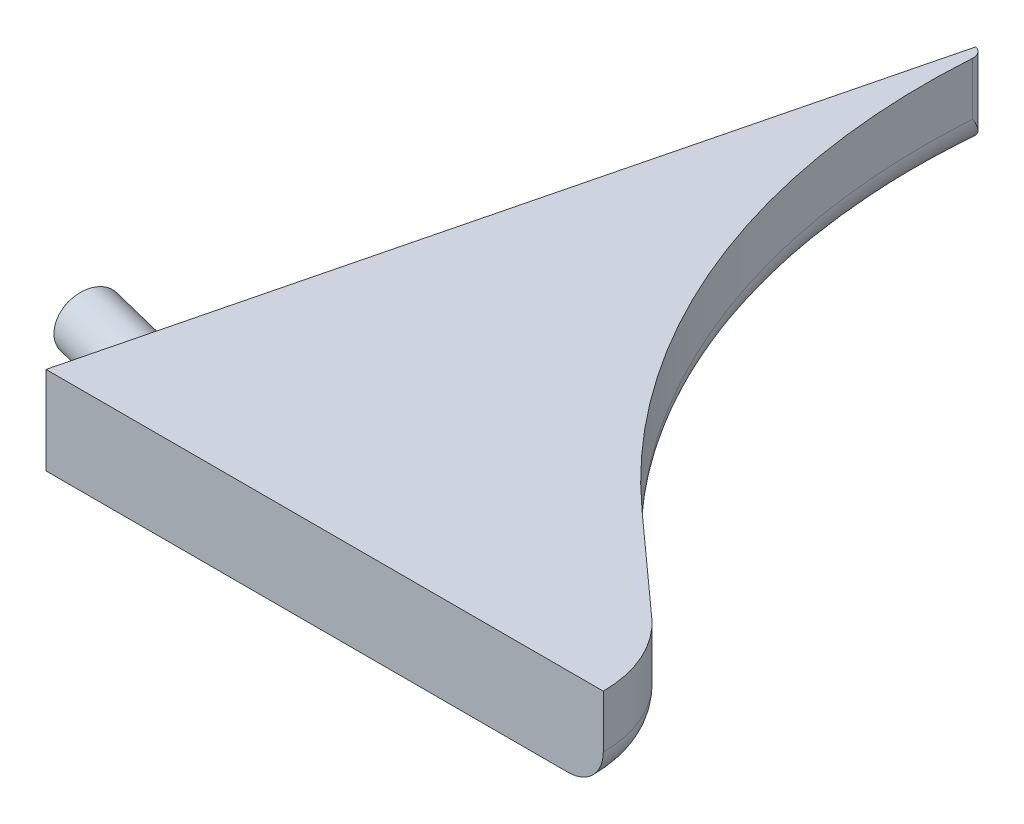
ISO-10303-21;
HEADER;
FILE_DESCRIPTION(('STEP AP214'),'2;1');
FILE_NAME('part.step','',(''),(''),'','','');
FILE_SCHEMA(('AUTOMOTIVE_DESIGN { 1 0 10303 214 1 1 1 1 }'));
ENDSEC;
DATA;
#1=APPLICATION_CONTEXT('core data for automotive mechanical design processes');
#2=APPLICATION_PROTOCOL_DEFINITION('international standard','automotive_design',2000,#1);
#3=PRODUCT_CONTEXT('',#1,'mechanical');
#4=PRODUCT('Part','Part','',(#3));
#5=PRODUCT_RELATED_PRODUCT_CATEGORY('part','',(#4));
#6=PRODUCT_DEFINITION_FORMATION('','',#4);
#7=PRODUCT_DEFINITION_CONTEXT('part definition',#1,'design');
#8=PRODUCT_DEFINITION('design','',#6,#7);
#9=PRODUCT_DEFINITION_SHAPE('','',#8);
#10=(LENGTH_UNIT() NAMED_UNIT(*) SI_UNIT(.MILLI.,.METRE.));
#11=(NAMED_UNIT(*) PLANE_ANGLE_UNIT() SI_UNIT($,.RADIAN.));
#12=(NAMED_UNIT(*) SI_UNIT($,.STERADIAN.) SOLID_ANGLE_UNIT());
#13=UNCERTAINTY_MEASURE_WITH_UNIT(LENGTH_MEASURE(1.E-05),#10,'distance_accuracy_value','');
#14=(GEOMETRIC_REPRESENTATION_CONTEXT(3) GLOBAL_UNCERTAINTY_ASSIGNED_CONTEXT((#13)) GLOBAL_UNIT_ASSIGNED_CONTEXT((#10,
#11,#12)) REPRESENTATION_CONTEXT('',''));
#15=CARTESIAN_POINT('',(0.,0.,0.));
#16=DIRECTION('',(0.,0.,1.));
#17=DIRECTION('',(1.,0.,0.));
#18=AXIS2_PLACEMENT_3D('',#15,#16,#17);
#19=CARTESIAN_POINT('',(0.,2.5,0.));
#20=DIRECTION('',(0.970295726275997,0.,0.241921895599665));
#21=DIRECTION('',(0.241921895599665,0.,-0.970295726275997));
#22=AXIS2_PLACEMENT_3D('',#19,#20,#21);
#23=PLANE('',#22);
#24=CARTESIAN_POINT('',(1.20960947799833,0.,-4.85147863137998));
#25=DIRECTION('',(-0.970295726275997,0.,-0.241921895599665));
#26=DIRECTION('',(-0.241921895599665,0.,0.970295726275997));
#27=AXIS2_PLACEMENT_3D('',#24,#25,#26);
#28=CIRCLE('',#27,2.075);
#29=CARTESIAN_POINT('',(0.707621544629021,0.,-2.83811499935729));
#30=VERTEX_POINT('',#29);
#31=EDGE_CURVE('E219',#30,#30,#28,.T.);
#32=ORIENTED_EDGE('',*,*,#31,.F.);
#33=EDGE_LOOP('',(#32));
#34=FACE_BOUND('',#33,.T.);
#35=DIRECTION('',(0.,-1.,0.));
#36=VECTOR('',#35,1.);
#37=CARTESIAN_POINT('',(10.5531692017754,2.5,-42.3264498228588));
#38=LINE('',#37,#36);
#39=CARTESIAN_POINT('',(10.5531692017754,2.5,-42.3264498228588));
#40=VERTEX_POINT('',#39);
#41=CARTESIAN_POINT('',(10.5531692017754,-1.84213425847109,-42.3264498228588));
#42=VERTEX_POINT('',#41);
#43=EDGE_CURVE('E230',#40,#42,#38,.T.);
#44=ORIENTED_EDGE('',*,*,#43,.T.);
#45=CARTESIAN_POINT('',(10.5531692017754,-1.84213425847109,-42.3264498228588));
#46=CARTESIAN_POINT('',(10.4736044924896,-1.90065699360431,-42.0073332038731));
#47=CARTESIAN_POINT('',(10.3939300597984,-1.95674922550737,-41.6877765083452));
#48=CARTESIAN_POINT('',(10.234325761706,-2.06295763678721,-41.0476386326458));
#49=CARTESIAN_POINT('',(10.1543958294855,-2.11307209433079,-40.7270571844768));
#50=CARTESIAN_POINT('',(9.99449992134999,-2.2060530563124,-40.0857497247766));
#51=CARTESIAN_POINT('',(9.9145345881216,-2.24893819994724,-39.7650262909203));
#52=CARTESIAN_POINT('',(9.75437250421148,-2.32625179990282,-39.1226512584982));
#53=CARTESIAN_POINT('',(9.67417577942809,-2.36068116811255,-38.8009997638049));
#54=CARTESIAN_POINT('',(9.5007796322979,-2.42415767381377,-38.1055458029466));
#55=CARTESIAN_POINT('',(9.40754142343489,-2.4514770750027,-37.7315877725618));
#56=CARTESIAN_POINT('',(9.26746681995411,-2.47990867365997,-37.1697792236485));
#57=CARTESIAN_POINT('',(9.22070384833268,-2.48729544484991,-36.9822231886738));
#58=CARTESIAN_POINT('',(9.12714216795215,-2.49733406836111,-36.606967784894));
#59=CARTESIAN_POINT('',(9.08034345511715,-2.49998525989731,-36.4192683997413));
#60=CARTESIAN_POINT('',(9.03354010471373,-2.5,-36.2315504143177));
#61=B_SPLINE_CURVE_WITH_KNOTS('',3,(#45,#46,#47,#48,#49,#50,#51,#52,#53,#54,#55,#56,#57,#58,#59,
#60),.UNSPECIFIED.,.F.,.F.,(4,2,2,2,2,2,2,4),(0.,1.00217811050621,2.00464419405296,
3.00448473989006,4.00421741338199,5.16300261939556,5.74326796530543,6.32361427294742),.UNSPECIFIED.);
#62=CARTESIAN_POINT('',(9.03354010471373,-2.5,-36.2315504143177));
#63=VERTEX_POINT('',#62);
#64=EDGE_CURVE('E11',#42,#63,#61,.T.);
#65=ORIENTED_EDGE('',*,*,#64,.T.);
#66=DIRECTION('',(-0.241921895599665,0.,0.970295726275997));
#67=VECTOR('',#66,1.);
#68=CARTESIAN_POINT('',(0.,-2.5,0.));
#69=LINE('',#68,#67);
#70=CARTESIAN_POINT('',(0.,-2.5,0.));
#71=VERTEX_POINT('',#70);
#72=EDGE_CURVE('E131',#63,#71,#69,.T.);
#73=ORIENTED_EDGE('',*,*,#72,.T.);
#74=DIRECTION('',(0.,-1.,0.));
#75=VECTOR('',#74,1.);
#76=CARTESIAN_POINT('',(0.,2.5,0.));
#77=LINE('',#76,#75);
#78=CARTESIAN_POINT('',(0.,2.5,0.));
#79=VERTEX_POINT('',#78);
#80=EDGE_CURVE('E115',#79,#71,#77,.T.);
#81=ORIENTED_EDGE('',*,*,#80,.F.);
#82=DIRECTION('',(-0.241921895599665,0.,0.970295726275997));
#83=VECTOR('',#82,1.);
#84=CARTESIAN_POINT('',(0.,2.5,0.));
#85=LINE('',#84,#83);
#86=EDGE_CURVE('E121',#40,#79,#85,.T.);
#87=ORIENTED_EDGE('',*,*,#86,.F.);
#88=EDGE_LOOP('',(#44,#65,#73,#81,#87));
#89=FACE_BOUND('',#88,.T.);
#90=ADVANCED_FACE('F41',(#34,#89),#23,.F.);
#91=CARTESIAN_POINT('',(0.,2.5,0.));
#92=DIRECTION('',(0.,0.,-1.));
#93=DIRECTION('',(-1.,0.,0.));
#94=AXIS2_PLACEMENT_3D('',#91,#92,#93);
#95=PLANE('',#94);
#96=DIRECTION('',(1.,0.,0.));
#97=VECTOR('',#96,1.);
#98=CARTESIAN_POINT('',(0.,-2.5,0.));
#99=LINE('',#98,#97);
#100=CARTESIAN_POINT('',(29.6928403320386,-2.5,0.));
#101=VERTEX_POINT('',#100);
#102=EDGE_CURVE('E128',#71,#101,#99,.T.);
#103=ORIENTED_EDGE('',*,*,#102,.T.);
#104=CARTESIAN_POINT('',(29.6928403320386,-0.5,0.));
#105=DIRECTION('',(0.,0.,-1.));
#106=DIRECTION('',(-1.,0.,0.));
#107=AXIS2_PLACEMENT_3D('',#104,#105,#106);
#108=CIRCLE('',#107,2.);
#109=CARTESIAN_POINT('',(31.6928403320386,-0.5,0.));
#110=VERTEX_POINT('',#109);
#111=EDGE_CURVE('E153',#101,#110,#108,.F.);
#112=ORIENTED_EDGE('',*,*,#111,.T.);
#113=DIRECTION('',(0.,-1.,0.));
#114=VECTOR('',#113,1.);
#115=CARTESIAN_POINT('',(31.6928403320386,2.5,0.));
#116=LINE('',#115,#114);
#117=CARTESIAN_POINT('',(31.6928403320386,2.5,0.));
#118=VERTEX_POINT('',#117);
#119=EDGE_CURVE('E117',#118,#110,#116,.T.);
#120=ORIENTED_EDGE('',*,*,#119,.F.);
#121=DIRECTION('',(1.,0.,0.));
#122=VECTOR('',#121,1.);
#123=CARTESIAN_POINT('',(0.,2.5,0.));
#124=LINE('',#123,#122);
#125=EDGE_CURVE('E110',#79,#118,#124,.T.);
#126=ORIENTED_EDGE('',*,*,#125,.F.);
#127=ORIENTED_EDGE('',*,*,#80,.T.);
#128=EDGE_LOOP('',(#103,#112,#120,#126,#127));
#129=FACE_BOUND('',#128,.T.);
#130=ADVANCED_FACE('F113',(#129),#95,.F.);
#131=CARTESIAN_POINT('',(25.,2.5,0.));
#132=DIRECTION('',(0.,-1.,0.));
#133=DIRECTION('',(0.,0.,-1.));
#134=AXIS2_PLACEMENT_3D('',#131,#132,#133);
#135=CYLINDRICAL_SURFACE('',#134,6.69284033203864);
#136=ORIENTED_EDGE('',*,*,#119,.T.);
#137=CARTESIAN_POINT('',(25.,-0.5,0.));
#138=DIRECTION('',(0.,1.,0.));
#139=DIRECTION('',(0.,0.,1.));
#140=AXIS2_PLACEMENT_3D('',#137,#138,#139);
#141=CIRCLE('',#140,6.69284033203864);
#142=CARTESIAN_POINT('',(29.4794111710163,-0.5,-4.97282487839029));
#143=VERTEX_POINT('',#142);
#144=EDGE_CURVE('E144',#110,#143,#141,.T.);
#145=ORIENTED_EDGE('',*,*,#144,.T.);
#146=DIRECTION('',(0.,-1.,0.));
#147=VECTOR('',#146,1.);
#148=CARTESIAN_POINT('',(29.4794111710163,2.5,-4.97282487839029));
#149=LINE('',#148,#147);
#150=CARTESIAN_POINT('',(29.4794111710163,2.5,-4.97282487839029));
#151=VERTEX_POINT('',#150);
#152=EDGE_CURVE('E138',#151,#143,#149,.T.);
#153=ORIENTED_EDGE('',*,*,#152,.F.);
#154=CARTESIAN_POINT('',(25.,2.5,0.));
#155=DIRECTION('',(0.,1.,0.));
#156=DIRECTION('',(0.,0.,1.));
#157=AXIS2_PLACEMENT_3D('',#154,#155,#156);
#158=CIRCLE('',#157,6.69284033203864);
#159=EDGE_CURVE('E120',#118,#151,#158,.T.);
#160=ORIENTED_EDGE('',*,*,#159,.F.);
#161=EDGE_LOOP('',(#136,#145,#153,#160));
#162=FACE_BOUND('',#161,.T.);
#163=ADVANCED_FACE('F181',(#162),#135,.T.);
#164=CARTESIAN_POINT('',(23.8549002403687,2.5,-10.039260498058));
#165=DIRECTION('',(-0.669284033203865,0.,0.743006650642083));
#166=DIRECTION('',(0.743006650642083,0.,0.669284033203865));
#167=AXIS2_PLACEMENT_3D('',#164,#165,#166);
#168=PLANE('',#167);
#169=ORIENTED_EDGE('',*,*,#152,.T.);
#170=DIRECTION('',(-0.743006650642083,0.,-0.669284033203865));
#171=VECTOR('',#170,1.);
#172=CARTESIAN_POINT('',(23.8549002403687,-0.5,-10.039260498058));
#173=LINE('',#172,#171);
#174=CARTESIAN_POINT('',(23.8549002403687,-0.5,-10.039260498058));
#175=VERTEX_POINT('',#174);
#176=EDGE_CURVE('E155',#143,#175,#173,.T.);
#177=ORIENTED_EDGE('',*,*,#176,.T.);
#178=DIRECTION('',(0.,-1.,0.));
#179=VECTOR('',#178,1.);
#180=CARTESIAN_POINT('',(23.8549002403687,2.5,-10.039260498058));
#181=LINE('',#180,#179);
#182=CARTESIAN_POINT('',(23.8549002403687,2.5,-10.039260498058));
#183=VERTEX_POINT('',#182);
#184=EDGE_CURVE('E234',#183,#175,#181,.T.);
#185=ORIENTED_EDGE('',*,*,#184,.F.);
#186=DIRECTION('',(-0.743006650642083,0.,-0.669284033203865));
#187=VECTOR('',#186,1.);
#188=CARTESIAN_POINT('',(23.8549002403687,2.5,-10.039260498058));
#189=LINE('',#188,#187);
#190=EDGE_CURVE('E239',#151,#183,#189,.T.);
#191=ORIENTED_EDGE('',*,*,#190,.F.);
#192=EDGE_LOOP('',(#169,#177,#185,#191));
#193=FACE_BOUND('',#192,.T.);
#194=ADVANCED_FACE('F178',(#193),#168,.F.);
#195=CARTESIAN_POINT('',(50.,2.5,-39.064281325336));
#196=DIRECTION('',(0.,-1.,0.));
#197=DIRECTION('',(0.,0.,-1.));
#198=AXIS2_PLACEMENT_3D('',#195,#196,#197);
#199=CYLINDRICAL_SURFACE('',#198,39.064281325336);
#200=ORIENTED_EDGE('',*,*,#184,.T.);
#201=CARTESIAN_POINT('',(50.,-0.5,-39.064281325336));
#202=DIRECTION('',(0.,1.,0.));
#203=DIRECTION('',(0.,0.,1.));
#204=AXIS2_PLACEMENT_3D('',#201,#202,#203);
#205=CIRCLE('',#204,39.064281325336);
#206=CARTESIAN_POINT('',(11.0234600353836,-0.5,-41.6810365396527));
#207=VERTEX_POINT('',#206);
#208=EDGE_CURVE('E66',#175,#207,#205,.F.);
#209=ORIENTED_EDGE('',*,*,#208,.T.);
#210=DIRECTION('',(0.,-1.,0.));
#211=VECTOR('',#210,1.);
#212=CARTESIAN_POINT('',(11.0234600353836,2.5,-41.6810365396527));
#213=LINE('',#212,#211);
#214=CARTESIAN_POINT('',(11.0234600353836,2.5,-41.6810365396527));
#215=VERTEX_POINT('',#214);
#216=EDGE_CURVE('E232',#215,#207,#213,.T.);
#217=ORIENTED_EDGE('',*,*,#216,.F.);
#218=CARTESIAN_POINT('',(50.,2.5,-39.064281325336));
#219=DIRECTION('',(0.,-1.,0.));
#220=DIRECTION('',(0.,0.,1.));
#221=AXIS2_PLACEMENT_3D('',#218,#219,#220);
#222=CIRCLE('',#221,39.064281325336);
#223=EDGE_CURVE('E241',#183,#215,#222,.T.);
#224=ORIENTED_EDGE('',*,*,#223,.F.);
#225=EDGE_LOOP('',(#200,#209,#217,#224));
#226=FACE_BOUND('',#225,.T.);
#227=ADVANCED_FACE('F173',(#226),#199,.F.);
#228=CARTESIAN_POINT('',(10.4026415107856,2.5,-41.7227162298679));
#229=DIRECTION('',(0.,-1.,0.));
#230=DIRECTION('',(0.,0.,-1.));
#231=AXIS2_PLACEMENT_3D('',#228,#229,#230);
#232=CYLINDRICAL_SURFACE('',#231,0.62221606943285);
#233=ORIENTED_EDGE('',*,*,#216,.T.);
#234=CARTESIAN_POINT('',(10.5531692017754,-1.84213425847109,-42.3264498228588));
#235=CARTESIAN_POINT('',(10.5787240925099,-1.81342077303304,-42.3200662935403));
#236=CARTESIAN_POINT('',(10.6031781353264,-1.78410441626142,-42.3122595480172));
#237=CARTESIAN_POINT('',(10.6498363389319,-1.72451585811791,-42.2942706195236));
#238=CARTESIAN_POINT('',(10.6720446533543,-1.69424556243192,-42.2840929414307));
#239=CARTESIAN_POINT('',(10.7350669360837,-1.6026473647285,-42.250820440383));
#240=CARTESIAN_POINT('',(10.7726407143271,-1.54011910549984,-42.2248824574302));
#241=CARTESIAN_POINT('',(10.856376739508,-1.38079748360859,-42.1535957154304));
#242=CARTESIAN_POINT('',(10.8972557405541,-1.28268411146188,-42.1050682002808));
#243=CARTESIAN_POINT('',(10.9619311981863,-1.08374948043426,-42.002102822041));
#244=CARTESIAN_POINT('',(10.9856610896422,-0.982919229006879,-41.9476428625034));
#245=CARTESIAN_POINT('',(11.0206033201424,-0.757466328250552,-41.8240049664862));
#246=CARTESIAN_POINT('',(11.0278787333669,-0.632520663571082,-41.7542389450933));
#247=CARTESIAN_POINT('',(11.0236484039771,-0.505217167708969,-41.6839174642601));
#248=CARTESIAN_POINT('',(11.023556716328,-0.502608523307459,-41.6824767959273));
#249=CARTESIAN_POINT('',(11.0234600353836,-0.5,-41.6810365396527));
#250=B_SPLINE_CURVE_WITH_KNOTS('',3,(#234,#235,#236,#237,#238,#239,#240,#241,#242,#243,#244,
#245,#246,#247,#248,#249),.UNSPECIFIED.,.F.,.F.,(4,2,2,2,2,2,2,4),(0.,0.116780284029613,
0.233340464468333,0.464803667704966,0.813456195141592,1.16345487057803,1.59097895313023,
1.59992323773839),.UNSPECIFIED.);
#251=EDGE_CURVE('E51',#207,#42,#250,.F.);
#252=ORIENTED_EDGE('',*,*,#251,.T.);
#253=ORIENTED_EDGE('',*,*,#43,.F.);
#254=CARTESIAN_POINT('',(10.4026415107856,2.5,-41.7227162298679));
#255=DIRECTION('',(0.,1.,0.));
#256=DIRECTION('',(0.,0.,1.));
#257=AXIS2_PLACEMENT_3D('',#254,#255,#256);
#258=CIRCLE('',#257,0.62221606943285);
#259=EDGE_CURVE('E126',#215,#40,#258,.T.);
#260=ORIENTED_EDGE('',*,*,#259,.F.);
#261=EDGE_LOOP('',(#233,#252,#253,#260));
#262=FACE_BOUND('',#261,.T.);
#263=ADVANCED_FACE('F168',(#262),#232,.T.);
#264=CARTESIAN_POINT('',(10.4026415107856,2.5,-41.7227162298679));
#265=DIRECTION('',(0.,1.,0.));
#266=DIRECTION('',(0.,0.,1.));
#267=AXIS2_PLACEMENT_3D('',#264,#265,#266);
#268=PLANE('',#267);
#269=ORIENTED_EDGE('',*,*,#86,.T.);
#270=ORIENTED_EDGE('',*,*,#125,.T.);
#271=ORIENTED_EDGE('',*,*,#159,.T.);
#272=ORIENTED_EDGE('',*,*,#190,.T.);
#273=ORIENTED_EDGE('',*,*,#223,.T.);
#274=ORIENTED_EDGE('',*,*,#259,.T.);
#275=EDGE_LOOP('',(#269,#270,#271,#272,#273,#274));
#276=FACE_BOUND('',#275,.T.);
#277=ADVANCED_FACE('F124',(#276),#268,.T.);
#278=CARTESIAN_POINT('',(10.4026415107856,-2.5,-41.7227162298679));
#279=DIRECTION('',(0.,1.,0.));
#280=DIRECTION('',(0.,0.,1.));
#281=AXIS2_PLACEMENT_3D('',#278,#279,#280);
#282=PLANE('',#281);
#283=DIRECTION('',(-0.743006650642083,0.,-0.669284033203865));
#284=VECTOR('',#283,1.);
#285=CARTESIAN_POINT('',(-0.665734442404647,-2.5,-29.4351424390223));
#286=LINE('',#285,#284);
#287=CARTESIAN_POINT('',(22.516332173961,-2.5,-8.5532471967738));
#288=VERTEX_POINT('',#287);
#289=CARTESIAN_POINT('',(28.1408431046086,-2.5,-3.48681157710612));
#290=VERTEX_POINT('',#289);
#291=EDGE_CURVE('E149',#288,#290,#286,.F.);
#292=ORIENTED_EDGE('',*,*,#291,.T.);
#293=CARTESIAN_POINT('',(25.,-2.5,0.));
#294=DIRECTION('',(0.,1.,0.));
#295=DIRECTION('',(0.,0.,1.));
#296=AXIS2_PLACEMENT_3D('',#293,#294,#295);
#297=CIRCLE('',#296,4.69284033203864);
#298=EDGE_CURVE('E151',#290,#101,#297,.F.);
#299=ORIENTED_EDGE('',*,*,#298,.T.);
#300=ORIENTED_EDGE('',*,*,#102,.F.);
#301=ORIENTED_EDGE('',*,*,#72,.F.);
#302=CARTESIAN_POINT('',(50.,-2.5,-39.064281325336));
#303=DIRECTION('',(0.,1.,0.));
#304=DIRECTION('',(0.,0.,1.));
#305=AXIS2_PLACEMENT_3D('',#302,#303,#304);
#306=CIRCLE('',#305,41.064281325336);
#307=EDGE_CURVE('E147',#63,#288,#306,.T.);
#308=ORIENTED_EDGE('',*,*,#307,.T.);
#309=EDGE_LOOP('',(#292,#299,#300,#301,#308));
#310=FACE_BOUND('',#309,.T.);
#311=ADVANCED_FACE('F174',(#310),#282,.F.);
#312=CARTESIAN_POINT('',(1.20960947799832,0.,-4.85147863137999));
#313=DIRECTION('',(-0.970295726275997,0.,-0.241921895599665));
#314=DIRECTION('',(-0.241921895599665,0.,0.970295726275997));
#315=AXIS2_PLACEMENT_3D('',#312,#313,#314);
#316=TOROIDAL_SURFACE('',#315,1.775,0.15);
#317=CARTESIAN_POINT('',(1.20960947799832,0.,-4.85147863137999));
#318=DIRECTION('',(-0.970295726275997,0.,-0.241921895599665));
#319=DIRECTION('',(-0.241921895599665,0.,0.970295726275997));
#320=AXIS2_PLACEMENT_3D('',#317,#318,#319);
#321=CIRCLE('',#320,1.625);
#322=CARTESIAN_POINT('',(1.60273255834778,0.,-6.42820918657848));
#323=VERTEX_POINT('',#322);
#324=EDGE_CURVE('E216',#323,#323,#321,.T.);
#325=ORIENTED_EDGE('',*,*,#324,.F.);
#326=EDGE_LOOP('',(#325));
#327=FACE_BOUND('',#326,.T.);
#328=CARTESIAN_POINT('',(1.31706685101772,0.,-4.82468649917429));
#329=DIRECTION('',(-0.970295726275997,0.,-0.241921895599665));
#330=DIRECTION('',(-0.241921895599665,0.,0.970295726275997));
#331=AXIS2_PLACEMENT_3D('',#328,#329,#330);
#332=CIRCLE('',#331,1.87616864452805);
#333=CARTESIAN_POINT('',(0.863180576068835,0.,-3.00424808161569));
#334=VERTEX_POINT('',#333);
#335=EDGE_CURVE('E226',#334,#334,#332,.T.);
#336=ORIENTED_EDGE('',*,*,#335,.T.);
#337=EDGE_LOOP('',(#336));
#338=FACE_BOUND('',#337,.T.);
#339=ADVANCED_FACE('F266',(#327,#338),#316,.F.);
#340=CARTESIAN_POINT('',(1.26039212589433,0.,-4.83881709520099));
#341=DIRECTION('',(-0.970295726275997,0.,-0.241921895599665));
#342=DIRECTION('',(-0.241921895599665,0.,0.970295726275997));
#343=AXIS2_PLACEMENT_3D('',#340,#341,#342);
#344=CONICAL_SURFACE('',#343,1.9401084739626,0.830566477643062);
#345=CARTESIAN_POINT('',(1.26039212589433,0.,-4.83881709520099));
#346=DIRECTION('',(-0.970295726275997,0.,-0.241921895599665));
#347=DIRECTION('',(-0.241921895599665,0.,0.970295726275997));
#348=AXIS2_PLACEMENT_3D('',#345,#346,#347);
#349=CIRCLE('',#348,1.9401084739626);
#350=CARTESIAN_POINT('',(0.791037406204327,0.,-2.95633813440323));
#351=VERTEX_POINT('',#350);
#352=EDGE_CURVE('E249',#351,#351,#349,.T.);
#353=CARTESIAN_POINT('',(0.863180576068835,0.,-3.00424808161569));
#354=CARTESIAN_POINT('',(0.86242908471608,0.,-3.00374901966556));
#355=CARTESIAN_POINT('',(0.861677593363325,0.,-3.00324995771543));
#356=CARTESIAN_POINT('',(0.860174610657814,0.,-3.00225183381517));
#357=CARTESIAN_POINT('',(0.859423119305059,0.,-3.00175277186504));
#358=CARTESIAN_POINT('',(0.857920136599548,0.,-3.00075464796478));
#359=CARTESIAN_POINT('',(0.857168645246793,0.,-3.00025558601465));
#360=CARTESIAN_POINT('',(0.855665662541283,0.,-2.99925746211439));
#361=CARTESIAN_POINT('',(0.854914171188527,0.,-2.99875840016426));
#362=CARTESIAN_POINT('',(0.853411188483017,0.,-2.997760276264));
#363=CARTESIAN_POINT('',(0.852659697130261,0.,-2.99726121431387));
#364=CARTESIAN_POINT('',(0.851156714424751,0.,-2.99626309041361));
#365=CARTESIAN_POINT('',(0.850405223071996,0.,-2.99576402846348));
#366=CARTESIAN_POINT('',(0.848902240366485,0.,-2.99476590456322));
#367=CARTESIAN_POINT('',(0.84815074901373,0.,-2.99426684261309));
#368=CARTESIAN_POINT('',(0.846647766308219,0.,-2.99326871871283));
#369=CARTESIAN_POINT('',(0.845896274955464,0.,-2.9927696567627));
#370=CARTESIAN_POINT('',(0.844393292249953,0.,-2.99177153286244));
#371=CARTESIAN_POINT('',(0.843641800897198,0.,-2.99127247091231));
#372=CARTESIAN_POINT('',(0.842138818191687,0.,-2.99027434701205));
#373=CARTESIAN_POINT('',(0.841387326838932,0.,-2.98977528506192));
#374=CARTESIAN_POINT('',(0.839884344133422,0.,-2.98877716116166));
#375=CARTESIAN_POINT('',(0.839132852780666,0.,-2.98827809921153));
#376=CARTESIAN_POINT('',(0.837629870075156,0.,-2.98727997531127));
#377=CARTESIAN_POINT('',(0.8368783787224,0.,-2.98678091336114));
#378=CARTESIAN_POINT('',(0.83537539601689,0.,-2.98578278946089));
#379=CARTESIAN_POINT('',(0.834623904664134,0.,-2.98528372751076));
#380=CARTESIAN_POINT('',(0.833120921958624,0.,-2.9842856036105));
#381=CARTESIAN_POINT('',(0.832369430605868,0.,-2.98378654166037));
#382=CARTESIAN_POINT('',(0.830866447900358,0.,-2.98278841776011));
#383=CARTESIAN_POINT('',(0.830114956547603,0.,-2.98228935580998));
#384=CARTESIAN_POINT('',(0.828611973842092,0.,-2.98129123190972));
#385=CARTESIAN_POINT('',(0.827860482489337,0.,-2.98079216995959));
#386=CARTESIAN_POINT('',(0.826357499783826,0.,-2.97979404605933));
#387=CARTESIAN_POINT('',(0.825606008431071,0.,-2.9792949841092));
#388=CARTESIAN_POINT('',(0.82410302572556,0.,-2.97829686020894));
#389=CARTESIAN_POINT('',(0.823351534372805,0.,-2.97779779825881));
#390=CARTESIAN_POINT('',(0.821848551667294,0.,-2.97679967435855));
#391=CARTESIAN_POINT('',(0.821097060314539,0.,-2.97630061240842));
#392=CARTESIAN_POINT('',(0.819594077609028,0.,-2.97530248850816));
#393=CARTESIAN_POINT('',(0.818842586256273,0.,-2.97480342655803));
#394=CARTESIAN_POINT('',(0.817339603550763,0.,-2.97380530265777));
#395=CARTESIAN_POINT('',(0.816588112198007,0.,-2.97330624070764));
#396=CARTESIAN_POINT('',(0.815085129492497,0.,-2.97230811680738));
#397=CARTESIAN_POINT('',(0.814333638139742,0.,-2.97180905485725));
#398=CARTESIAN_POINT('',(0.812830655434231,0.,-2.97081093095699));
#399=CARTESIAN_POINT('',(0.812079164081476,0.,-2.97031186900686));
#400=CARTESIAN_POINT('',(0.810576181375965,0.,-2.9693137451066));
#401=CARTESIAN_POINT('',(0.80982469002321,0.,-2.96881468315647));
#402=CARTESIAN_POINT('',(0.808321707317699,0.,-2.96781655925621));
#403=CARTESIAN_POINT('',(0.807570215964944,0.,-2.96731749730608));
#404=CARTESIAN_POINT('',(0.806067233259433,0.,-2.96631937340582));
#405=CARTESIAN_POINT('',(0.805315741906678,0.,-2.96582031145569));
#406=CARTESIAN_POINT('',(0.803812759201167,0.,-2.96482218755544));
#407=CARTESIAN_POINT('',(0.803061267848412,0.,-2.96432312560531));
#408=CARTESIAN_POINT('',(0.801558285142901,0.,-2.96332500170505));
#409=CARTESIAN_POINT('',(0.800806793790146,0.,-2.96282593975492));
#410=CARTESIAN_POINT('',(0.799303811084636,0.,-2.96182781585466));
#411=CARTESIAN_POINT('',(0.79855231973188,0.,-2.96132875390453));
#412=CARTESIAN_POINT('',(0.79704933702637,0.,-2.96033063000427));
#413=CARTESIAN_POINT('',(0.796297845673614,0.,-2.95983156805414));
#414=CARTESIAN_POINT('',(0.794794862968104,0.,-2.95883344415388));
#415=CARTESIAN_POINT('',(0.794043371615348,0.,-2.95833438220375));
#416=CARTESIAN_POINT('',(0.792540388909838,0.,-2.95733625830349));
#417=CARTESIAN_POINT('',(0.791788897557083,0.,-2.95683719635336));
#418=CARTESIAN_POINT('',(0.791037406204327,0.,-2.95633813440323));
#419=B_SPLINE_CURVE_WITH_KNOTS('',3,(#353,#354,#355,#356,#357,#358,#359,#360,#361,#362,#363,
#364,#365,#366,#367,#368,#369,#370,#371,#372,#373,#374,#375,#376,#377,#378,#379,#380,#381,#382,
#383,#384,#385,#386,#387,#388,#389,#390,#391,#392,#393,#394,#395,#396,#397,#398,#399,#400,#401,
#402,#403,#404,#405,#406,#407,#408,#409,#410,#411,#412,#413,#414,#415,#416,#417,#418),
.UNSPECIFIED.,.F.,.F.,(4,2,2,2,2,2,2,2,2,2,2,2,2,2,2,2,2,2,2,2,2,2,2,2,2,2,2,2,2,2,2,2,4),(0.,
0.00270632938682652,0.00541265877365264,0.00811898816047877,0.0108253175473052,
0.0135316469341316,0.016237976320958,0.0189443057077841,0.0216506350946104,0.0243569644814367,
0.0270632938682631,0.0297696232550895,0.0324759526419157,0.035182282028742,0.0378886114155682,
0.0405949408023948,0.0433012701892211,0.0460075995760476,0.0487139289628735,0.0514202583496998,
0.0541265877365261,0.0568329171233525,0.0595392465101791,0.0622455758970053,0.0649519052838318,
0.0676582346706578,0.0703645640574842,0.0730708934443105,0.0757772228311369,0.0784835522179633,
0.0811898816047894,0.0838962109916158,0.0866025403784422),.UNSPECIFIED.);
#420=EDGE_CURVE('BSEAM257',#334,#351,#419,.T.);
#421=ORIENTED_EDGE('',*,*,#335,.F.);
#422=ORIENTED_EDGE('',*,*,#352,.T.);
#423=ORIENTED_EDGE('',*,*,#420,.T.);
#424=ORIENTED_EDGE('',*,*,#420,.F.);
#425=EDGE_LOOP('',(#421,#423,#422,#424));
#426=FACE_BOUND('',#425,.T.);
#427=ADVANCED_FACE('F257',(#426),#344,.F.);
#428=CARTESIAN_POINT('',(1.40366862325352,0.,-4.80309425226005));
#429=DIRECTION('',(-0.970295726275997,0.,-0.241921895599665));
#430=DIRECTION('',(-0.241921895599665,0.,0.970295726275997));
#431=AXIS2_PLACEMENT_3D('',#428,#429,#430);
#432=TOROIDAL_SURFACE('',#431,2.075,0.199999999999999);
#433=ORIENTED_EDGE('',*,*,#352,.F.);
#434=EDGE_LOOP('',(#433));
#435=FACE_BOUND('',#434,.T.);
#436=ORIENTED_EDGE('',*,*,#31,.T.);
#437=EDGE_LOOP('',(#436));
#438=FACE_BOUND('',#437,.T.);
#439=ADVANCED_FACE('F255',(#435,#438),#432,.T.);
#440=CARTESIAN_POINT('',(-4.12701701651966,0.,-6.18204905717814));
#441=DIRECTION('',(-0.970295726275997,0.,-0.241921895599665));
#442=DIRECTION('',(-0.241921895599665,0.,0.970295726275997));
#443=AXIS2_PLACEMENT_3D('',#440,#441,#442);
#444=PLANE('',#443);
#445=CARTESIAN_POINT('',(-4.12701701651966,0.,-6.18204905717814));
#446=DIRECTION('',(-0.970295726275997,0.,-0.241921895599665));
#447=DIRECTION('',(-0.241921895599665,0.,0.970295726275997));
#448=AXIS2_PLACEMENT_3D('',#445,#446,#447);
#449=CIRCLE('',#448,1.125);
#450=CARTESIAN_POINT('',(-3.85485488397004,0.,-7.27363174923864));
#451=VERTEX_POINT('',#450);
#452=EDGE_CURVE('E133',#451,#451,#449,.T.);
#453=ORIENTED_EDGE('',*,*,#452,.T.);
#454=EDGE_LOOP('',(#453));
#455=FACE_BOUND('',#454,.T.);
#456=ADVANCED_FACE('F198',(#455),#444,.T.);
#457=CARTESIAN_POINT('',(-4.12701701651966,0.,-6.18204905717814));
#458=DIRECTION('',(0.970295726275997,0.,0.241921895599665));
#459=DIRECTION('',(0.241921895599665,0.,-0.970295726275997));
#460=AXIS2_PLACEMENT_3D('',#457,#458,#459);
#461=CONICAL_SURFACE('',#460,1.125,0.78539816339745);
#462=CARTESIAN_POINT('',(-3.64186915338166,0.,-6.06108810937831));
#463=DIRECTION('',(-0.970295726275997,0.,-0.241921895599665));
#464=DIRECTION('',(-0.241921895599665,0.,0.970295726275997));
#465=AXIS2_PLACEMENT_3D('',#462,#463,#464);
#466=CIRCLE('',#465,1.625);
#467=CARTESIAN_POINT('',(-3.24874607303221,0.,-7.63781866457681));
#468=VERTEX_POINT('',#467);
#469=EDGE_CURVE('E136',#468,#468,#466,.F.);
#470=CARTESIAN_POINT('',(-3.24874607303221,0.,-7.63781866457681));
#471=CARTESIAN_POINT('',(-3.25505970647948,0.,-7.63402505087537));
#472=CARTESIAN_POINT('',(-3.26137333992675,0.,-7.63023143717393));
#473=CARTESIAN_POINT('',(-3.27400060682128,0.,-7.62264420977105));
#474=CARTESIAN_POINT('',(-3.28031424026855,0.,-7.61885059606961));
#475=CARTESIAN_POINT('',(-3.29294150716309,0.,-7.61126336866673));
#476=CARTESIAN_POINT('',(-3.29925514061036,0.,-7.60746975496529));
#477=CARTESIAN_POINT('',(-3.3118824075049,0.,-7.59988252756242));
#478=CARTESIAN_POINT('',(-3.31819604095217,0.,-7.59608891386098));
#479=CARTESIAN_POINT('',(-3.33082330784671,0.,-7.5885016864581));
#480=CARTESIAN_POINT('',(-3.33713694129397,0.,-7.58470807275666));
#481=CARTESIAN_POINT('',(-3.34976420818851,0.,-7.57712084535378));
#482=CARTESIAN_POINT('',(-3.35607784163578,0.,-7.57332723165234));
#483=CARTESIAN_POINT('',(-3.36870510853032,0.,-7.56574000424946));
#484=CARTESIAN_POINT('',(-3.37501874197759,0.,-7.56194639054802));
#485=CARTESIAN_POINT('',(-3.38764600887213,0.,-7.55435916314515));
#486=CARTESIAN_POINT('',(-3.3939596423194,0.,-7.55056554944371));
#487=CARTESIAN_POINT('',(-3.40658690921393,0.,-7.54297832204083));
#488=CARTESIAN_POINT('',(-3.4129005426612,0.,-7.53918470833939));
#489=CARTESIAN_POINT('',(-3.42552780955574,0.,-7.53159748093651));
#490=CARTESIAN_POINT('',(-3.43184144300301,0.,-7.52780386723507));
#491=CARTESIAN_POINT('',(-3.44446870989755,0.,-7.52021663983219));
#492=CARTESIAN_POINT('',(-3.45078234334482,0.,-7.51642302613075));
#493=CARTESIAN_POINT('',(-3.46340961023936,0.,-7.50883579872787));
#494=CARTESIAN_POINT('',(-3.46972324368662,0.,-7.50504218502644));
#495=CARTESIAN_POINT('',(-3.48235051058116,0.,-7.49745495762356));
#496=CARTESIAN_POINT('',(-3.48866414402843,0.,-7.49366134392212));
#497=CARTESIAN_POINT('',(-3.50129141092297,0.,-7.48607411651924));
#498=CARTESIAN_POINT('',(-3.50760504437024,0.,-7.4822805028178));
#499=CARTESIAN_POINT('',(-3.52023231126478,0.,-7.47469327541492));
#500=CARTESIAN_POINT('',(-3.52654594471205,0.,-7.47089966171348));
#501=CARTESIAN_POINT('',(-3.53917321160658,0.,-7.4633124343106));
#502=CARTESIAN_POINT('',(-3.54548684505385,0.,-7.45951882060916));
#503=CARTESIAN_POINT('',(-3.55811411194839,0.,-7.45193159320629));
#504=CARTESIAN_POINT('',(-3.56442774539566,0.,-7.44813797950485));
#505=CARTESIAN_POINT('',(-3.5770550122902,0.,-7.44055075210197));
#506=CARTESIAN_POINT('',(-3.58336864573747,0.,-7.43675713840053));
#507=CARTESIAN_POINT('',(-3.595995912632,0.,-7.42916991099765));
#508=CARTESIAN_POINT('',(-3.60230954607927,0.,-7.42537629729621));
#509=CARTESIAN_POINT('',(-3.61493681297381,0.,-7.41778906989333));
#510=CARTESIAN_POINT('',(-3.62125044642108,0.,-7.41399545619189));
#511=CARTESIAN_POINT('',(-3.63387771331562,0.,-7.40640822878901));
#512=CARTESIAN_POINT('',(-3.64019134676289,0.,-7.40261461508757));
#513=CARTESIAN_POINT('',(-3.65281861365743,0.,-7.3950273876847));
#514=CARTESIAN_POINT('',(-3.65913224710469,0.,-7.39123377398326));
#515=CARTESIAN_POINT('',(-3.67175951399923,0.,-7.38364654658038));
#516=CARTESIAN_POINT('',(-3.6780731474465,0.,-7.37985293287894));
#517=CARTESIAN_POINT('',(-3.69070041434104,0.,-7.37226570547606));
#518=CARTESIAN_POINT('',(-3.69701404778831,0.,-7.36847209177462));
#519=CARTESIAN_POINT('',(-3.70964131468285,0.,-7.36088486437174));
#520=CARTESIAN_POINT('',(-3.71595494813012,0.,-7.3570912506703));
#521=CARTESIAN_POINT('',(-3.72858221502465,0.,-7.34950402326743));
#522=CARTESIAN_POINT('',(-3.73489584847192,0.,-7.34571040956599));
#523=CARTESIAN_POINT('',(-3.74752311536646,0.,-7.33812318216311));
#524=CARTESIAN_POINT('',(-3.75383674881373,0.,-7.33432956846167));
#525=CARTESIAN_POINT('',(-3.76646401570827,0.,-7.32674234105879));
#526=CARTESIAN_POINT('',(-3.77277764915554,0.,-7.32294872735735));
#527=CARTESIAN_POINT('',(-3.78540491605008,0.,-7.31536149995447));
#528=CARTESIAN_POINT('',(-3.79171854949734,0.,-7.31156788625303));
#529=CARTESIAN_POINT('',(-3.80434581639188,0.,-7.30398065885016));
#530=CARTESIAN_POINT('',(-3.81065944983915,0.,-7.30018704514872));
#531=CARTESIAN_POINT('',(-3.82328671673369,0.,-7.29259981774584));
#532=CARTESIAN_POINT('',(-3.82960035018096,0.,-7.2888062040444));
#533=CARTESIAN_POINT('',(-3.8422276170755,0.,-7.28121897664152));
#534=CARTESIAN_POINT('',(-3.84854125052277,0.,-7.27742536294008));
#535=CARTESIAN_POINT('',(-3.85485488397004,0.,-7.27363174923864));
#536=B_SPLINE_CURVE_WITH_KNOTS('',3,(#470,#471,#472,#473,#474,#475,#476,#477,#478,#479,#480,
#481,#482,#483,#484,#485,#486,#487,#488,#489,#490,#491,#492,#493,#494,#495,#496,#497,#498,#499,
#500,#501,#502,#503,#504,#505,#506,#507,#508,#509,#510,#511,#512,#513,#514,#515,#516,#517,#518,
#519,#520,#521,#522,#523,#524,#525,#526,#527,#528,#529,#530,#531,#532,#533,#534,#535),
.UNSPECIFIED.,.F.,.F.,(4,2,2,2,2,2,2,2,2,2,2,2,2,2,2,2,2,2,2,2,2,2,2,2,2,2,2,2,2,2,2,2,4),(0.,
0.0220970869120797,0.0441941738241593,0.0662912607362386,0.0883883476483183,0.110485434560398,
0.132582521472477,0.154679608384557,0.176776695296636,0.198873782208716,0.220970869120795,
0.243067956032874,0.265165042944955,0.287262129857034,0.309359216769113,0.331456303681194,
0.353553390593272,0.375650477505352,0.397747564417431,0.419844651329511,0.44194173824159,
0.46403882515367,0.486135912065749,0.508232998977829,0.530330085889908,0.552427172801987,
0.574524259714067,0.596621346626147,0.618718433538226,0.640815520450306,0.662912607362385,
0.685009694274465,0.707106781186544),.UNSPECIFIED.);
#537=EDGE_CURVE('BSEAM192',#468,#451,#536,.T.);
#538=ORIENTED_EDGE('',*,*,#469,.F.);
#539=ORIENTED_EDGE('',*,*,#452,.F.);
#540=ORIENTED_EDGE('',*,*,#537,.T.);
#541=ORIENTED_EDGE('',*,*,#537,.F.);
#542=EDGE_LOOP('',(#538,#540,#539,#541));
#543=FACE_BOUND('',#542,.T.);
#544=ADVANCED_FACE('F192',(#543),#461,.T.);
#545=CARTESIAN_POINT('',(-4.12701701651966,0.,-6.18204905717814));
#546=DIRECTION('',(0.970295726275997,0.,0.241921895599665));
#547=DIRECTION('',(0.241921895599665,0.,-0.970295726275997));
#548=AXIS2_PLACEMENT_3D('',#545,#546,#547);
#549=CYLINDRICAL_SURFACE('',#548,1.625);
#550=CARTESIAN_POINT('',(-3.24874607303221,0.,-7.63781866457681));
#551=CARTESIAN_POINT('',(-3.19820983728867,0.,-7.62521856584766));
#552=CARTESIAN_POINT('',(-3.14767360154513,0.,-7.61261846711851));
#553=CARTESIAN_POINT('',(-3.04660113005804,0.,-7.58741826966021));
#554=CARTESIAN_POINT('',(-2.9960648943145,0.,-7.57481817093106));
#555=CARTESIAN_POINT('',(-2.89499242282742,0.,-7.54961797347276));
#556=CARTESIAN_POINT('',(-2.84445618708388,0.,-7.53701787474361));
#557=CARTESIAN_POINT('',(-2.74338371559679,0.,-7.51181767728531));
#558=CARTESIAN_POINT('',(-2.69284747985325,0.,-7.49921757855616));
#559=CARTESIAN_POINT('',(-2.59177500836617,0.,-7.47401738109787));
#560=CARTESIAN_POINT('',(-2.54123877262263,0.,-7.46141728236872));
#561=CARTESIAN_POINT('',(-2.44016630113554,0.,-7.43621708491042));
#562=CARTESIAN_POINT('',(-2.389630065392,0.,-7.42361698618127));
#563=CARTESIAN_POINT('',(-2.28855759390492,0.,-7.39841678872297));
#564=CARTESIAN_POINT('',(-2.23802135816138,0.,-7.38581668999382));
#565=CARTESIAN_POINT('',(-2.1369488866743,0.,-7.36061649253552));
#566=CARTESIAN_POINT('',(-2.08641265093075,0.,-7.34801639380638));
#567=CARTESIAN_POINT('',(-1.98534017944367,0.,-7.32281619634808));
#568=CARTESIAN_POINT('',(-1.93480394370013,0.,-7.31021609761893));
#569=CARTESIAN_POINT('',(-1.83373147221305,0.,-7.28501590016063));
#570=CARTESIAN_POINT('',(-1.7831952364695,0.,-7.27241580143148));
#571=CARTESIAN_POINT('',(-1.68212276498242,0.,-7.24721560397318));
#572=CARTESIAN_POINT('',(-1.63158652923888,0.,-7.23461550524403));
#573=CARTESIAN_POINT('',(-1.5305140577518,0.,-7.20941530778573));
#574=CARTESIAN_POINT('',(-1.47997782200826,0.,-7.19681520905658));
#575=CARTESIAN_POINT('',(-1.37890535052117,0.,-7.17161501159829));
#576=CARTESIAN_POINT('',(-1.32836911477763,0.,-7.15901491286914));
#577=CARTESIAN_POINT('',(-1.22729664329055,0.,-7.13381471541084));
#578=CARTESIAN_POINT('',(-1.17676040754701,0.,-7.12121461668169));
#579=CARTESIAN_POINT('',(-1.07568793605992,0.,-7.09601441922339));
#580=CARTESIAN_POINT('',(-1.02515170031638,0.,-7.08341432049424));
#581=CARTESIAN_POINT('',(-0.924079228829299,0.,-7.05821412303594));
#582=CARTESIAN_POINT('',(-0.873542993085757,0.,-7.04561402430679));
#583=CARTESIAN_POINT('',(-0.772470521598674,0.,-7.0204138268485));
#584=CARTESIAN_POINT('',(-0.721934285855132,0.,-7.00781372811934));
#585=CARTESIAN_POINT('',(-0.620861814368049,0.,-6.98261353066105));
#586=CARTESIAN_POINT('',(-0.570325578624508,0.,-6.9700134319319));
#587=CARTESIAN_POINT('',(-0.469253107137425,0.,-6.9448132344736));
#588=CARTESIAN_POINT('',(-0.418716871393884,0.,-6.93221313574445));
#589=CARTESIAN_POINT('',(-0.3176443999068,0.,-6.90701293828615));
#590=CARTESIAN_POINT('',(-0.267108164163259,0.,-6.894412839557));
#591=CARTESIAN_POINT('',(-0.166035692676176,0.,-6.8692126420987));
#592=CARTESIAN_POINT('',(-0.115499456932634,0.,-6.85661254336956));
#593=CARTESIAN_POINT('',(-0.0144269854455513,0.,-6.83141234591126));
#594=CARTESIAN_POINT('',(0.0361092502979905,0.,-6.81881224718211));
#595=CARTESIAN_POINT('',(0.137181721785074,0.,-6.79361204972381));
#596=CARTESIAN_POINT('',(0.187717957528616,0.,-6.78101195099466));
#597=CARTESIAN_POINT('',(0.288790429015698,0.,-6.75581175353636));
#598=CARTESIAN_POINT('',(0.339326664759239,0.,-6.74321165480721));
#599=CARTESIAN_POINT('',(0.440399136246322,0.,-6.71801145734891));
#600=CARTESIAN_POINT('',(0.490935371989864,0.,-6.70541135861976));
#601=CARTESIAN_POINT('',(0.592007843476947,0.,-6.68021116116147));
#602=CARTESIAN_POINT('',(0.642544079220489,0.,-6.66761106243232));
#603=CARTESIAN_POINT('',(0.743616550707572,0.,-6.64241086497402));
#604=CARTESIAN_POINT('',(0.794152786451113,0.,-6.62981076624487));
#605=CARTESIAN_POINT('',(0.895225257938196,0.,-6.60461056878657));
#606=CARTESIAN_POINT('',(0.945761493681738,0.,-6.59201047005742));
#607=CARTESIAN_POINT('',(1.04683396516882,0.,-6.56681027259912));
#608=CARTESIAN_POINT('',(1.09737020091236,0.,-6.55421017386997));
#609=CARTESIAN_POINT('',(1.19844267239944,0.,-6.52900997641168));
#610=CARTESIAN_POINT('',(1.24897890814299,0.,-6.51640987768253));
#611=CARTESIAN_POINT('',(1.35005137963007,0.,-6.49120968022423));
#612=CARTESIAN_POINT('',(1.40058761537361,0.,-6.47860958149508));
#613=CARTESIAN_POINT('',(1.50166008686069,0.,-6.45340938403678));
#614=CARTESIAN_POINT('',(1.55219632260424,0.,-6.44080928530763));
#615=CARTESIAN_POINT('',(1.60273255834778,0.,-6.42820918657848));
#616=B_SPLINE_CURVE_WITH_KNOTS('',3,(#550,#551,#552,#553,#554,#555,#556,#557,#558,#559,#560,
#561,#562,#563,#564,#565,#566,#567,#568,#569,#570,#571,#572,#573,#574,#575,#576,#577,#578,#579,
#580,#581,#582,#583,#584,#585,#586,#587,#588,#589,#590,#591,#592,#593,#594,#595,#596,#597,#598,
#599,#600,#601,#602,#603,#604,#605,#606,#607,#608,#609,#610,#611,#612,#613,#614,#615),
.UNSPECIFIED.,.F.,.F.,(4,2,2,2,2,2,2,2,2,2,2,2,2,2,2,2,2,2,2,2,2,2,2,2,2,2,2,2,2,2,2,2,4),(0.,
0.15625,0.3125,0.46875,0.625,0.78125,0.9375,1.09375,1.25,1.40625,1.5625,1.71875,1.875,2.03125,
2.1875,2.34375,2.5,2.65625,2.8125,2.96875,3.125,3.28125,3.4375,3.59375,3.75,3.90625,4.0625,
4.21875,4.375,4.53125,4.6875,4.84375,5.),.UNSPECIFIED.);
#617=EDGE_CURVE('BSEAM197',#468,#323,#616,.T.);
#618=ORIENTED_EDGE('',*,*,#469,.T.);
#619=ORIENTED_EDGE('',*,*,#324,.T.);
#620=ORIENTED_EDGE('',*,*,#617,.T.);
#621=ORIENTED_EDGE('',*,*,#617,.F.);
#622=EDGE_LOOP('',(#618,#620,#619,#621));
#623=FACE_BOUND('',#622,.T.);
#624=ADVANCED_FACE('F197',(#623),#549,.T.);
#625=CARTESIAN_POINT('',(50.,-0.5,-39.064281325336));
#626=DIRECTION('',(0.,1.,0.));
#627=DIRECTION('',(0.,0.,1.));
#628=AXIS2_PLACEMENT_3D('',#625,#626,#627);
#629=TOROIDAL_SURFACE('',#628,41.064281325336,2.);
#630=ORIENTED_EDGE('',*,*,#251,.F.);
#631=ORIENTED_EDGE('',*,*,#208,.F.);
#632=CARTESIAN_POINT('',(22.516332173961,-0.5,-8.5532471967738));
#633=DIRECTION('',(0.743006650642083,0.,0.669284033203866));
#634=DIRECTION('',(0.669284033203866,0.,-0.743006650642083));
#635=AXIS2_PLACEMENT_3D('',#632,#633,#634);
#636=CIRCLE('',#635,2.);
#637=EDGE_CURVE('E46',#288,#175,#636,.T.);
#638=ORIENTED_EDGE('',*,*,#637,.F.);
#639=ORIENTED_EDGE('',*,*,#307,.F.);
#640=ORIENTED_EDGE('',*,*,#64,.F.);
#641=EDGE_LOOP('',(#630,#631,#638,#639,#640));
#642=FACE_BOUND('',#641,.T.);
#643=ADVANCED_FACE('F43',(#642),#629,.T.);
#644=CARTESIAN_POINT('',(22.516332173961,-0.5,-8.55324719677381));
#645=DIRECTION('',(-0.743006650642083,0.,-0.669284033203865));
#646=DIRECTION('',(-0.669284033203865,0.,0.743006650642083));
#647=AXIS2_PLACEMENT_3D('',#644,#645,#646);
#648=CYLINDRICAL_SURFACE('',#647,2.);
#649=ORIENTED_EDGE('',*,*,#637,.T.);
#650=ORIENTED_EDGE('',*,*,#176,.F.);
#651=CARTESIAN_POINT('',(28.1408431046086,-0.5,-3.48681157710612));
#652=DIRECTION('',(0.743006650642085,0.,0.669284033203864));
#653=DIRECTION('',(0.669284033203864,0.,-0.743006650642085));
#654=AXIS2_PLACEMENT_3D('',#651,#652,#653);
#655=CIRCLE('',#654,2.);
#656=EDGE_CURVE('E217',#290,#143,#655,.T.);
#657=ORIENTED_EDGE('',*,*,#656,.F.);
#658=ORIENTED_EDGE('',*,*,#291,.F.);
#659=EDGE_LOOP('',(#649,#650,#657,#658));
#660=FACE_BOUND('',#659,.T.);
#661=ADVANCED_FACE('F202',(#660),#648,.T.);
#662=CARTESIAN_POINT('',(25.,-0.5,0.));
#663=DIRECTION('',(0.,1.,0.));
#664=DIRECTION('',(0.,0.,1.));
#665=AXIS2_PLACEMENT_3D('',#662,#663,#664);
#666=TOROIDAL_SURFACE('',#665,4.69284033203864,2.);
#667=ORIENTED_EDGE('',*,*,#111,.F.);
#668=ORIENTED_EDGE('',*,*,#298,.F.);
#669=ORIENTED_EDGE('',*,*,#656,.T.);
#670=ORIENTED_EDGE('',*,*,#144,.F.);
#671=EDGE_LOOP('',(#667,#668,#669,#670));
#672=FACE_BOUND('',#671,.T.);
#673=ADVANCED_FACE('F200',(#672),#666,.T.);
#674=CLOSED_SHELL('',(#90,#130,#163,#194,#227,#263,#277,#311,#339,#427,#439,#456,#544,#624,#643,
#661,#673));
#675=MANIFOLD_SOLID_BREP('B2',#674);
#676=ADVANCED_BREP_SHAPE_REPRESENTATION('',(#18,#675),#14);
#677=SHAPE_DEFINITION_REPRESENTATION(#9,#676);
ENDSEC;
END-ISO-10303-21;
